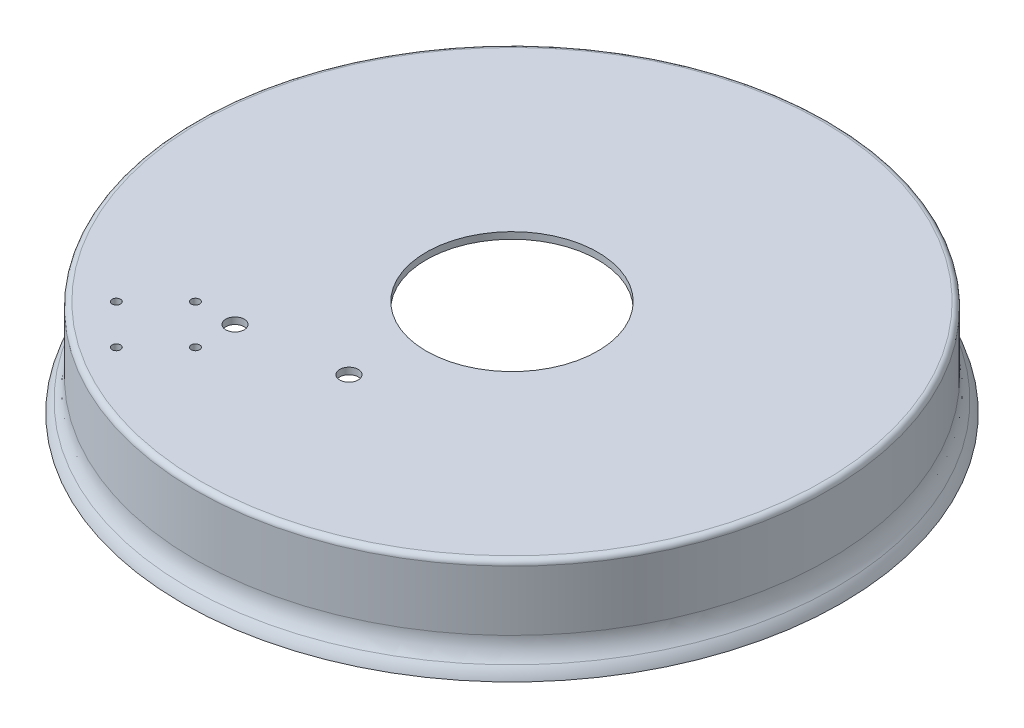
ISO-10303-21;
HEADER;
FILE_DESCRIPTION(('STEP AP214'),'2;1');
FILE_NAME('part.step','',(''),(''),'','','');
FILE_SCHEMA(('AUTOMOTIVE_DESIGN { 1 0 10303 214 1 1 1 1 }'));
ENDSEC;
DATA;
#1=APPLICATION_CONTEXT('core data for automotive mechanical design processes');
#2=APPLICATION_PROTOCOL_DEFINITION('international standard','automotive_design',2000,#1);
#3=PRODUCT_CONTEXT('',#1,'mechanical');
#4=PRODUCT('Part','Part','',(#3));
#5=PRODUCT_RELATED_PRODUCT_CATEGORY('part','',(#4));
#6=PRODUCT_DEFINITION_FORMATION('','',#4);
#7=PRODUCT_DEFINITION_CONTEXT('part definition',#1,'design');
#8=PRODUCT_DEFINITION('design','',#6,#7);
#9=PRODUCT_DEFINITION_SHAPE('','',#8);
#10=(LENGTH_UNIT() NAMED_UNIT(*) SI_UNIT(.MILLI.,.METRE.));
#11=(NAMED_UNIT(*) PLANE_ANGLE_UNIT() SI_UNIT($,.RADIAN.));
#12=(NAMED_UNIT(*) SI_UNIT($,.STERADIAN.) SOLID_ANGLE_UNIT());
#13=UNCERTAINTY_MEASURE_WITH_UNIT(LENGTH_MEASURE(1.E-05),#10,'distance_accuracy_value','');
#14=(GEOMETRIC_REPRESENTATION_CONTEXT(3) GLOBAL_UNCERTAINTY_ASSIGNED_CONTEXT((#13)) GLOBAL_UNIT_ASSIGNED_CONTEXT((#10,
#11,#12)) REPRESENTATION_CONTEXT('',''));
#15=CARTESIAN_POINT('',(0.,0.,0.));
#16=DIRECTION('',(0.,0.,1.));
#17=DIRECTION('',(1.,0.,0.));
#18=AXIS2_PLACEMENT_3D('',#15,#16,#17);
#19=CARTESIAN_POINT('',(0.,32.,0.));
#20=DIRECTION('',(0.,-1.,0.));
#21=DIRECTION('',(0.,0.,-1.));
#22=AXIS2_PLACEMENT_3D('',#19,#20,#21);
#23=CYLINDRICAL_SURFACE('',#22,120.);
#24=CARTESIAN_POINT('',(0.,9.74679434480896,0.));
#25=DIRECTION('',(0.,-1.,0.));
#26=DIRECTION('',(0.,0.,-1.));
#27=AXIS2_PLACEMENT_3D('',#24,#25,#26);
#28=CIRCLE('',#27,120.);
#29=CARTESIAN_POINT('',(0.,9.74679434480896,-120.));
#30=VERTEX_POINT('',#29);
#31=EDGE_CURVE('E46',#30,#30,#28,.F.);
#32=ORIENTED_EDGE('',*,*,#31,.T.);
#33=EDGE_LOOP('',(#32));
#34=FACE_BOUND('',#33,.T.);
#35=CARTESIAN_POINT('',(0.,32.5,0.));
#36=DIRECTION('',(0.,1.,0.));
#37=DIRECTION('',(0.,0.,1.));
#38=AXIS2_PLACEMENT_3D('',#35,#36,#37);
#39=CIRCLE('',#38,120.);
#40=CARTESIAN_POINT('',(0.,32.5,120.));
#41=VERTEX_POINT('',#40);
#42=EDGE_CURVE('E51',#41,#41,#39,.F.);
#43=ORIENTED_EDGE('',*,*,#42,.T.);
#44=EDGE_LOOP('',(#43));
#45=FACE_BOUND('',#44,.T.);
#46=ADVANCED_FACE('F38',(#34,#45),#23,.T.);
#47=CARTESIAN_POINT('',(0.,32.,0.));
#48=DIRECTION('',(0.,-1.,0.));
#49=DIRECTION('',(0.,0.,-1.));
#50=AXIS2_PLACEMENT_3D('',#47,#48,#49);
#51=CYLINDRICAL_SURFACE('',#50,118.);
#52=CARTESIAN_POINT('',(0.,32.,0.));
#53=DIRECTION('',(0.,1.,0.));
#54=DIRECTION('',(0.,0.,1.));
#55=AXIS2_PLACEMENT_3D('',#52,#53,#54);
#56=CIRCLE('',#55,118.);
#57=CARTESIAN_POINT('',(0.,32.,118.));
#58=VERTEX_POINT('',#57);
#59=EDGE_CURVE('E62',#58,#58,#56,.T.);
#60=ORIENTED_EDGE('',*,*,#59,.T.);
#61=EDGE_LOOP('',(#60));
#62=FACE_BOUND('',#61,.T.);
#63=CARTESIAN_POINT('',(0.,-2.,0.));
#64=DIRECTION('',(0.,-1.,0.));
#65=DIRECTION('',(0.,0.,-1.));
#66=AXIS2_PLACEMENT_3D('',#63,#64,#65);
#67=CIRCLE('',#66,118.);
#68=CARTESIAN_POINT('',(0.,-2.,-118.));
#69=VERTEX_POINT('',#68);
#70=EDGE_CURVE('E118',#69,#69,#67,.T.);
#71=ORIENTED_EDGE('',*,*,#70,.T.);
#72=EDGE_LOOP('',(#71));
#73=FACE_BOUND('',#72,.T.);
#74=ADVANCED_FACE('F162',(#62,#73),#51,.F.);
#75=CARTESIAN_POINT('',(0.,32.,0.));
#76=DIRECTION('',(0.,1.,0.));
#77=DIRECTION('',(0.,0.,1.));
#78=AXIS2_PLACEMENT_3D('',#75,#76,#77);
#79=PLANE('',#78);
#80=CARTESIAN_POINT('',(-6.91624264494906,32.,54.8774224568979));
#81=DIRECTION('',(0.,1.,0.));
#82=DIRECTION('',(0.,0.,1.));
#83=AXIS2_PLACEMENT_3D('',#80,#81,#82);
#84=CIRCLE('',#83,3.5);
#85=CARTESIAN_POINT('',(-6.91624264494906,32.,58.3774224568979));
#86=VERTEX_POINT('',#85);
#87=EDGE_CURVE('E122',#86,#86,#84,.T.);
#88=ORIENTED_EDGE('',*,*,#87,.T.);
#89=EDGE_LOOP('',(#88));
#90=FACE_BOUND('',#89,.T.);
#91=CARTESIAN_POINT('',(-45.,32.,60.));
#92=DIRECTION('',(0.,1.,0.));
#93=DIRECTION('',(0.,0.,1.));
#94=AXIS2_PLACEMENT_3D('',#91,#92,#93);
#95=CIRCLE('',#94,3.5);
#96=CARTESIAN_POINT('',(-45.,32.,63.5));
#97=VERTEX_POINT('',#96);
#98=EDGE_CURVE('E84',#97,#97,#95,.F.);
#99=ORIENTED_EDGE('',*,*,#98,.F.);
#100=EDGE_LOOP('',(#99));
#101=FACE_BOUND('',#100,.T.);
#102=CARTESIAN_POINT('',(-75.,32.,75.));
#103=DIRECTION('',(0.,1.,0.));
#104=DIRECTION('',(0.,0.,1.));
#105=AXIS2_PLACEMENT_3D('',#102,#103,#104);
#106=CIRCLE('',#105,1.60000000000001);
#107=CARTESIAN_POINT('',(-75.,32.,76.6));
#108=VERTEX_POINT('',#107);
#109=EDGE_CURVE('E71',#108,#108,#106,.F.);
#110=ORIENTED_EDGE('',*,*,#109,.F.);
#111=EDGE_LOOP('',(#110));
#112=FACE_BOUND('',#111,.T.);
#113=CARTESIAN_POINT('',(-60.,32.,60.));
#114=DIRECTION('',(0.,1.,0.));
#115=DIRECTION('',(0.,0.,1.));
#116=AXIS2_PLACEMENT_3D('',#113,#114,#115);
#117=CIRCLE('',#116,1.60000000000001);
#118=CARTESIAN_POINT('',(-60.,32.,61.6));
#119=VERTEX_POINT('',#118);
#120=EDGE_CURVE('E93',#119,#119,#117,.F.);
#121=ORIENTED_EDGE('',*,*,#120,.F.);
#122=EDGE_LOOP('',(#121));
#123=FACE_BOUND('',#122,.T.);
#124=CARTESIAN_POINT('',(-45.,32.,75.));
#125=DIRECTION('',(0.,1.,0.));
#126=DIRECTION('',(0.,0.,1.));
#127=AXIS2_PLACEMENT_3D('',#124,#125,#126);
#128=CIRCLE('',#127,1.60000000000001);
#129=CARTESIAN_POINT('',(-45.,32.,76.6));
#130=VERTEX_POINT('',#129);
#131=EDGE_CURVE('E85',#130,#130,#128,.F.);
#132=ORIENTED_EDGE('',*,*,#131,.F.);
#133=EDGE_LOOP('',(#132));
#134=FACE_BOUND('',#133,.T.);
#135=CARTESIAN_POINT('',(-60.,32.,90.));
#136=DIRECTION('',(0.,1.,0.));
#137=DIRECTION('',(0.,0.,1.));
#138=AXIS2_PLACEMENT_3D('',#135,#136,#137);
#139=CIRCLE('',#138,1.60000000000001);
#140=CARTESIAN_POINT('',(-60.,32.,91.6));
#141=VERTEX_POINT('',#140);
#142=EDGE_CURVE('E75',#141,#141,#139,.F.);
#143=ORIENTED_EDGE('',*,*,#142,.F.);
#144=EDGE_LOOP('',(#143));
#145=FACE_BOUND('',#144,.T.);
#146=CARTESIAN_POINT('',(0.,32.,0.));
#147=DIRECTION('',(0.,1.,0.));
#148=DIRECTION('',(0.,0.,1.));
#149=AXIS2_PLACEMENT_3D('',#146,#147,#148);
#150=CIRCLE('',#149,32.5);
#151=CARTESIAN_POINT('',(0.,32.,32.5));
#152=VERTEX_POINT('',#151);
#153=EDGE_CURVE('E67',#152,#152,#150,.T.);
#154=ORIENTED_EDGE('',*,*,#153,.T.);
#155=EDGE_LOOP('',(#154));
#156=FACE_BOUND('',#155,.T.);
#157=ORIENTED_EDGE('',*,*,#59,.F.);
#158=EDGE_LOOP('',(#157));
#159=FACE_BOUND('',#158,.T.);
#160=ADVANCED_FACE('F138',(#90,#101,#112,#123,#134,#145,#156,#159),#79,.F.);
#161=CARTESIAN_POINT('',(0.,34.5,0.));
#162=DIRECTION('',(0.,1.,0.));
#163=DIRECTION('',(0.,0.,1.));
#164=AXIS2_PLACEMENT_3D('',#161,#162,#163);
#165=PLANE('',#164);
#166=CARTESIAN_POINT('',(-6.91624264494906,34.5,54.8774224568979));
#167=DIRECTION('',(0.,1.,0.));
#168=DIRECTION('',(0.,0.,1.));
#169=AXIS2_PLACEMENT_3D('',#166,#167,#168);
#170=CIRCLE('',#169,3.5);
#171=CARTESIAN_POINT('',(-6.91624264494906,34.5,58.3774224568979));
#172=VERTEX_POINT('',#171);
#173=EDGE_CURVE('E126',#172,#172,#170,.T.);
#174=ORIENTED_EDGE('',*,*,#173,.F.);
#175=EDGE_LOOP('',(#174));
#176=FACE_BOUND('',#175,.T.);
#177=CARTESIAN_POINT('',(0.,34.5,0.));
#178=DIRECTION('',(0.,1.,0.));
#179=DIRECTION('',(0.,0.,1.));
#180=AXIS2_PLACEMENT_3D('',#177,#178,#179);
#181=CIRCLE('',#180,118.);
#182=CARTESIAN_POINT('',(0.,34.5,118.));
#183=VERTEX_POINT('',#182);
#184=EDGE_CURVE('E56',#183,#183,#181,.T.);
#185=ORIENTED_EDGE('',*,*,#184,.T.);
#186=EDGE_LOOP('',(#185));
#187=FACE_BOUND('',#186,.T.);
#188=CARTESIAN_POINT('',(-45.,34.5,60.));
#189=DIRECTION('',(0.,1.,0.));
#190=DIRECTION('',(0.,0.,1.));
#191=AXIS2_PLACEMENT_3D('',#188,#189,#190);
#192=CIRCLE('',#191,3.5);
#193=CARTESIAN_POINT('',(-45.,34.5,63.5));
#194=VERTEX_POINT('',#193);
#195=EDGE_CURVE('E110',#194,#194,#192,.T.);
#196=ORIENTED_EDGE('',*,*,#195,.F.);
#197=EDGE_LOOP('',(#196));
#198=FACE_BOUND('',#197,.T.);
#199=CARTESIAN_POINT('',(-75.,34.5,75.));
#200=DIRECTION('',(0.,1.,0.));
#201=DIRECTION('',(0.,0.,1.));
#202=AXIS2_PLACEMENT_3D('',#199,#200,#201);
#203=CIRCLE('',#202,1.60000000000001);
#204=CARTESIAN_POINT('',(-75.,34.5,76.6));
#205=VERTEX_POINT('',#204);
#206=EDGE_CURVE('E97',#205,#205,#203,.T.);
#207=ORIENTED_EDGE('',*,*,#206,.F.);
#208=EDGE_LOOP('',(#207));
#209=FACE_BOUND('',#208,.T.);
#210=CARTESIAN_POINT('',(-60.,34.5,60.));
#211=DIRECTION('',(0.,1.,0.));
#212=DIRECTION('',(0.,0.,1.));
#213=AXIS2_PLACEMENT_3D('',#210,#211,#212);
#214=CIRCLE('',#213,1.60000000000001);
#215=CARTESIAN_POINT('',(-60.,34.5,61.6));
#216=VERTEX_POINT('',#215);
#217=EDGE_CURVE('E89',#216,#216,#214,.T.);
#218=ORIENTED_EDGE('',*,*,#217,.F.);
#219=EDGE_LOOP('',(#218));
#220=FACE_BOUND('',#219,.T.);
#221=CARTESIAN_POINT('',(-45.,34.5,75.));
#222=DIRECTION('',(0.,1.,0.));
#223=DIRECTION('',(0.,0.,1.));
#224=AXIS2_PLACEMENT_3D('',#221,#222,#223);
#225=CIRCLE('',#224,1.60000000000001);
#226=CARTESIAN_POINT('',(-45.,34.5,76.6));
#227=VERTEX_POINT('',#226);
#228=EDGE_CURVE('E79',#227,#227,#225,.T.);
#229=ORIENTED_EDGE('',*,*,#228,.F.);
#230=EDGE_LOOP('',(#229));
#231=FACE_BOUND('',#230,.T.);
#232=CARTESIAN_POINT('',(-60.,34.5,90.));
#233=DIRECTION('',(0.,1.,0.));
#234=DIRECTION('',(0.,0.,1.));
#235=AXIS2_PLACEMENT_3D('',#232,#233,#234);
#236=CIRCLE('',#235,1.60000000000001);
#237=CARTESIAN_POINT('',(-60.,34.5,91.6));
#238=VERTEX_POINT('',#237);
#239=EDGE_CURVE('E80',#238,#238,#236,.T.);
#240=ORIENTED_EDGE('',*,*,#239,.F.);
#241=EDGE_LOOP('',(#240));
#242=FACE_BOUND('',#241,.T.);
#243=CARTESIAN_POINT('',(0.,34.5,0.));
#244=DIRECTION('',(0.,1.,0.));
#245=DIRECTION('',(0.,0.,1.));
#246=AXIS2_PLACEMENT_3D('',#243,#244,#245);
#247=CIRCLE('',#246,32.5);
#248=CARTESIAN_POINT('',(0.,34.5,32.5));
#249=VERTEX_POINT('',#248);
#250=EDGE_CURVE('E66',#249,#249,#247,.T.);
#251=ORIENTED_EDGE('',*,*,#250,.F.);
#252=EDGE_LOOP('',(#251));
#253=FACE_BOUND('',#252,.T.);
#254=ADVANCED_FACE('F134',(#176,#187,#198,#209,#220,#231,#242,#253),#165,.T.);
#255=CARTESIAN_POINT('',(0.,34.5,0.));
#256=DIRECTION('',(0.,-1.,0.));
#257=DIRECTION('',(0.,0.,-1.));
#258=AXIS2_PLACEMENT_3D('',#255,#256,#257);
#259=CYLINDRICAL_SURFACE('',#258,32.5);
#260=ORIENTED_EDGE('',*,*,#250,.T.);
#261=EDGE_LOOP('',(#260));
#262=FACE_BOUND('',#261,.T.);
#263=ORIENTED_EDGE('',*,*,#153,.F.);
#264=EDGE_LOOP('',(#263));
#265=FACE_BOUND('',#264,.T.);
#266=ADVANCED_FACE('F137',(#262,#265),#259,.F.);
#267=CARTESIAN_POINT('',(-60.,27.4745166004061,90.));
#268=DIRECTION('',(0.,1.,0.));
#269=DIRECTION('',(0.,0.,1.));
#270=AXIS2_PLACEMENT_3D('',#267,#268,#269);
#271=CYLINDRICAL_SURFACE('',#270,1.60000000000001);
#272=ORIENTED_EDGE('',*,*,#142,.T.);
#273=EDGE_LOOP('',(#272));
#274=FACE_BOUND('',#273,.T.);
#275=ORIENTED_EDGE('',*,*,#239,.T.);
#276=EDGE_LOOP('',(#275));
#277=FACE_BOUND('',#276,.T.);
#278=ADVANCED_FACE('F156',(#274,#277),#271,.F.);
#279=CARTESIAN_POINT('',(-45.,27.4745166004061,75.));
#280=DIRECTION('',(0.,1.,0.));
#281=DIRECTION('',(0.,0.,1.));
#282=AXIS2_PLACEMENT_3D('',#279,#280,#281);
#283=CYLINDRICAL_SURFACE('',#282,1.60000000000001);
#284=ORIENTED_EDGE('',*,*,#131,.T.);
#285=EDGE_LOOP('',(#284));
#286=FACE_BOUND('',#285,.T.);
#287=ORIENTED_EDGE('',*,*,#228,.T.);
#288=EDGE_LOOP('',(#287));
#289=FACE_BOUND('',#288,.T.);
#290=ADVANCED_FACE('F196',(#286,#289),#283,.F.);
#291=CARTESIAN_POINT('',(-60.,27.4745166004061,60.));
#292=DIRECTION('',(0.,1.,0.));
#293=DIRECTION('',(0.,0.,1.));
#294=AXIS2_PLACEMENT_3D('',#291,#292,#293);
#295=CYLINDRICAL_SURFACE('',#294,1.60000000000001);
#296=ORIENTED_EDGE('',*,*,#120,.T.);
#297=EDGE_LOOP('',(#296));
#298=FACE_BOUND('',#297,.T.);
#299=ORIENTED_EDGE('',*,*,#217,.T.);
#300=EDGE_LOOP('',(#299));
#301=FACE_BOUND('',#300,.T.);
#302=ADVANCED_FACE('F200',(#298,#301),#295,.F.);
#303=CARTESIAN_POINT('',(-75.,27.4745166004061,75.));
#304=DIRECTION('',(0.,1.,0.));
#305=DIRECTION('',(0.,0.,1.));
#306=AXIS2_PLACEMENT_3D('',#303,#304,#305);
#307=CYLINDRICAL_SURFACE('',#306,1.60000000000001);
#308=ORIENTED_EDGE('',*,*,#109,.T.);
#309=EDGE_LOOP('',(#308));
#310=FACE_BOUND('',#309,.T.);
#311=ORIENTED_EDGE('',*,*,#206,.T.);
#312=EDGE_LOOP('',(#311));
#313=FACE_BOUND('',#312,.T.);
#314=ADVANCED_FACE('F204',(#310,#313),#307,.F.);
#315=CARTESIAN_POINT('',(-45.,22.1005050633883,60.));
#316=DIRECTION('',(0.,1.,0.));
#317=DIRECTION('',(0.,0.,1.));
#318=AXIS2_PLACEMENT_3D('',#315,#316,#317);
#319=CYLINDRICAL_SURFACE('',#318,3.5);
#320=CARTESIAN_POINT('',(-45.,32.,63.5));
#321=CARTESIAN_POINT('',(-45.,32.0260416666667,63.5));
#322=CARTESIAN_POINT('',(-45.,32.0520833333333,63.5));
#323=CARTESIAN_POINT('',(-45.,32.1041666666667,63.5));
#324=CARTESIAN_POINT('',(-45.,32.1302083333333,63.5));
#325=CARTESIAN_POINT('',(-45.,32.1822916666667,63.5));
#326=CARTESIAN_POINT('',(-45.,32.2083333333333,63.5));
#327=CARTESIAN_POINT('',(-45.,32.2604166666667,63.5));
#328=CARTESIAN_POINT('',(-45.,32.2864583333333,63.5));
#329=CARTESIAN_POINT('',(-45.,32.3385416666667,63.5));
#330=CARTESIAN_POINT('',(-45.,32.3645833333333,63.5));
#331=CARTESIAN_POINT('',(-45.,32.4166666666667,63.5));
#332=CARTESIAN_POINT('',(-45.,32.4427083333333,63.5));
#333=CARTESIAN_POINT('',(-45.,32.4947916666667,63.5));
#334=CARTESIAN_POINT('',(-45.,32.5208333333333,63.5));
#335=CARTESIAN_POINT('',(-45.,32.5729166666667,63.5));
#336=CARTESIAN_POINT('',(-45.,32.5989583333333,63.5));
#337=CARTESIAN_POINT('',(-45.,32.6510416666667,63.5));
#338=CARTESIAN_POINT('',(-45.,32.6770833333333,63.5));
#339=CARTESIAN_POINT('',(-45.,32.7291666666667,63.5));
#340=CARTESIAN_POINT('',(-45.,32.7552083333333,63.5));
#341=CARTESIAN_POINT('',(-45.,32.8072916666667,63.5));
#342=CARTESIAN_POINT('',(-45.,32.8333333333333,63.5));
#343=CARTESIAN_POINT('',(-45.,32.8854166666667,63.5));
#344=CARTESIAN_POINT('',(-45.,32.9114583333333,63.5));
#345=CARTESIAN_POINT('',(-45.,32.9635416666667,63.5));
#346=CARTESIAN_POINT('',(-45.,32.9895833333333,63.5));
#347=CARTESIAN_POINT('',(-45.,33.0416666666667,63.5));
#348=CARTESIAN_POINT('',(-45.,33.0677083333333,63.5));
#349=CARTESIAN_POINT('',(-45.,33.1197916666667,63.5));
#350=CARTESIAN_POINT('',(-45.,33.1458333333333,63.5));
#351=CARTESIAN_POINT('',(-45.,33.1979166666667,63.5));
#352=CARTESIAN_POINT('',(-45.,33.2239583333333,63.5));
#353=CARTESIAN_POINT('',(-45.,33.2760416666667,63.5));
#354=CARTESIAN_POINT('',(-45.,33.3020833333333,63.5));
#355=CARTESIAN_POINT('',(-45.,33.3541666666667,63.5));
#356=CARTESIAN_POINT('',(-45.,33.3802083333333,63.5));
#357=CARTESIAN_POINT('',(-45.,33.4322916666667,63.5));
#358=CARTESIAN_POINT('',(-45.,33.4583333333333,63.5));
#359=CARTESIAN_POINT('',(-45.,33.5104166666667,63.5));
#360=CARTESIAN_POINT('',(-45.,33.5364583333333,63.5));
#361=CARTESIAN_POINT('',(-45.,33.5885416666667,63.5));
#362=CARTESIAN_POINT('',(-45.,33.6145833333333,63.5));
#363=CARTESIAN_POINT('',(-45.,33.6666666666667,63.5));
#364=CARTESIAN_POINT('',(-45.,33.6927083333333,63.5));
#365=CARTESIAN_POINT('',(-45.,33.7447916666667,63.5));
#366=CARTESIAN_POINT('',(-45.,33.7708333333333,63.5));
#367=CARTESIAN_POINT('',(-45.,33.8229166666667,63.5));
#368=CARTESIAN_POINT('',(-45.,33.8489583333333,63.5));
#369=CARTESIAN_POINT('',(-45.,33.9010416666667,63.5));
#370=CARTESIAN_POINT('',(-45.,33.9270833333333,63.5));
#371=CARTESIAN_POINT('',(-45.,33.9791666666667,63.5));
#372=CARTESIAN_POINT('',(-45.,34.0052083333333,63.5));
#373=CARTESIAN_POINT('',(-45.,34.0572916666667,63.5));
#374=CARTESIAN_POINT('',(-45.,34.0833333333333,63.5));
#375=CARTESIAN_POINT('',(-45.,34.1354166666667,63.5));
#376=CARTESIAN_POINT('',(-45.,34.1614583333333,63.5));
#377=CARTESIAN_POINT('',(-45.,34.2135416666667,63.5));
#378=CARTESIAN_POINT('',(-45.,34.2395833333333,63.5));
#379=CARTESIAN_POINT('',(-45.,34.2916666666667,63.5));
#380=CARTESIAN_POINT('',(-45.,34.3177083333333,63.5));
#381=CARTESIAN_POINT('',(-45.,34.3697916666667,63.5));
#382=CARTESIAN_POINT('',(-45.,34.3958333333333,63.5));
#383=CARTESIAN_POINT('',(-45.,34.4479166666667,63.5));
#384=CARTESIAN_POINT('',(-45.,34.4739583333333,63.5));
#385=CARTESIAN_POINT('',(-45.,34.5,63.5));
#386=B_SPLINE_CURVE_WITH_KNOTS('',3,(#320,#321,#322,#323,#324,#325,#326,#327,#328,#329,#330,
#331,#332,#333,#334,#335,#336,#337,#338,#339,#340,#341,#342,#343,#344,#345,#346,#347,#348,#349,
#350,#351,#352,#353,#354,#355,#356,#357,#358,#359,#360,#361,#362,#363,#364,#365,#366,#367,#368,
#369,#370,#371,#372,#373,#374,#375,#376,#377,#378,#379,#380,#381,#382,#383,#384,#385),
.UNSPECIFIED.,.F.,.F.,(4,2,2,2,2,2,2,2,2,2,2,2,2,2,2,2,2,2,2,2,2,2,2,2,2,2,2,2,2,2,2,2,4),(0.,
0.0781250000000053,0.156250000000004,0.234375000000002,0.3125,0.390624999999999,
0.468750000000004,0.546875000000002,0.625000000000001,0.703125000000006,0.781250000000004,
0.859375000000002,0.937500000000001,1.015625,1.09375,1.171875,1.25,1.32812500000001,1.40625,
1.484375,1.5625,1.640625,1.71875,1.796875,1.875,1.95312500000001,2.03125000000001,2.109375,
2.1875,2.265625,2.34375000000001,2.421875,2.5),.UNSPECIFIED.);
#387=EDGE_CURVE('BSEAM182',#97,#194,#386,.T.);
#388=ORIENTED_EDGE('',*,*,#98,.T.);
#389=ORIENTED_EDGE('',*,*,#195,.T.);
#390=ORIENTED_EDGE('',*,*,#387,.T.);
#391=ORIENTED_EDGE('',*,*,#387,.F.);
#392=EDGE_LOOP('',(#388,#390,#389,#391));
#393=FACE_BOUND('',#392,.T.);
#394=ADVANCED_FACE('F182',(#393),#319,.F.);
#395=CARTESIAN_POINT('',(0.,32.5,0.));
#396=DIRECTION('',(0.,1.,0.));
#397=DIRECTION('',(0.,0.,1.));
#398=AXIS2_PLACEMENT_3D('',#395,#396,#397);
#399=TOROIDAL_SURFACE('',#398,118.,2.);
#400=ORIENTED_EDGE('',*,*,#42,.F.);
#401=EDGE_LOOP('',(#400));
#402=FACE_BOUND('',#401,.T.);
#403=ORIENTED_EDGE('',*,*,#184,.F.);
#404=EDGE_LOOP('',(#403));
#405=FACE_BOUND('',#404,.T.);
#406=ADVANCED_FACE('F175',(#402,#405),#399,.T.);
#407=CARTESIAN_POINT('',(0.,-2.,0.));
#408=DIRECTION('',(0.,-1.,0.));
#409=DIRECTION('',(0.,0.,-1.));
#410=AXIS2_PLACEMENT_3D('',#407,#408,#409);
#411=PLANE('',#410);
#412=CARTESIAN_POINT('',(0.,-2.,0.));
#413=DIRECTION('',(0.,-1.,0.));
#414=DIRECTION('',(0.,0.,-1.));
#415=AXIS2_PLACEMENT_3D('',#412,#413,#414);
#416=CIRCLE('',#415,125.);
#417=CARTESIAN_POINT('',(0.,-2.,-125.));
#418=VERTEX_POINT('',#417);
#419=EDGE_CURVE('E114',#418,#418,#416,.T.);
#420=ORIENTED_EDGE('',*,*,#419,.T.);
#421=EDGE_LOOP('',(#420));
#422=FACE_BOUND('',#421,.T.);
#423=ORIENTED_EDGE('',*,*,#70,.F.);
#424=EDGE_LOOP('',(#423));
#425=FACE_BOUND('',#424,.T.);
#426=ADVANCED_FACE('F172',(#422,#425),#411,.T.);
#427=CARTESIAN_POINT('',(0.,9.74679434480896,0.));
#428=DIRECTION('',(0.,-1.,0.));
#429=DIRECTION('',(0.,0.,-1.));
#430=AXIS2_PLACEMENT_3D('',#427,#428,#429);
#431=TOROIDAL_SURFACE('',#430,132.,12.);
#432=CARTESIAN_POINT('',(0.,2.06883545898666,0.));
#433=DIRECTION('',(0.,1.,0.));
#434=DIRECTION('',(0.,0.,1.));
#435=AXIS2_PLACEMENT_3D('',#432,#433,#434);
#436=CIRCLE('',#435,122.77780138212);
#437=CARTESIAN_POINT('',(0.,2.06883545898666,122.77780138212));
#438=VERTEX_POINT('',#437);
#439=EDGE_CURVE('E10',#438,#438,#436,.T.);
#440=ORIENTED_EDGE('',*,*,#439,.T.);
#441=EDGE_LOOP('',(#440));
#442=FACE_BOUND('',#441,.T.);
#443=ORIENTED_EDGE('',*,*,#31,.F.);
#444=EDGE_LOOP('',(#443));
#445=FACE_BOUND('',#444,.T.);
#446=ADVANCED_FACE('F174',(#442,#445),#431,.F.);
#447=CARTESIAN_POINT('',(0.,-5.60912342683496,0.));
#448=DIRECTION('',(0.,-1.,0.));
#449=DIRECTION('',(0.,0.,-1.));
#450=AXIS2_PLACEMENT_3D('',#447,#448,#449);
#451=TOROIDAL_SURFACE('',#450,113.55560276424,12.);
#452=ORIENTED_EDGE('',*,*,#439,.F.);
#453=EDGE_LOOP('',(#452));
#454=FACE_BOUND('',#453,.T.);
#455=ORIENTED_EDGE('',*,*,#419,.F.);
#456=EDGE_LOOP('',(#455));
#457=FACE_BOUND('',#456,.T.);
#458=ADVANCED_FACE('F40',(#454,#457),#451,.T.);
#459=CARTESIAN_POINT('',(-6.91624264494906,8.49999999999999,54.8774224568979));
#460=DIRECTION('',(0.,1.,0.));
#461=DIRECTION('',(0.,0.,1.));
#462=AXIS2_PLACEMENT_3D('',#459,#460,#461);
#463=CYLINDRICAL_SURFACE('',#462,3.5);
#464=ORIENTED_EDGE('',*,*,#173,.T.);
#465=EDGE_LOOP('',(#464));
#466=FACE_BOUND('',#465,.T.);
#467=ORIENTED_EDGE('',*,*,#87,.F.);
#468=EDGE_LOOP('',(#467));
#469=FACE_BOUND('',#468,.T.);
#470=ADVANCED_FACE('F131',(#466,#469),#463,.F.);
#471=CLOSED_SHELL('',(#46,#74,#160,#254,#266,#278,#290,#302,#314,#394,#406,#426,#446,#458,#470));
#472=MANIFOLD_SOLID_BREP('B2',#471);
#473=ADVANCED_BREP_SHAPE_REPRESENTATION('',(#18,#472),#14);
#474=SHAPE_DEFINITION_REPRESENTATION(#9,#473);
ENDSEC;
END-ISO-10303-21;
